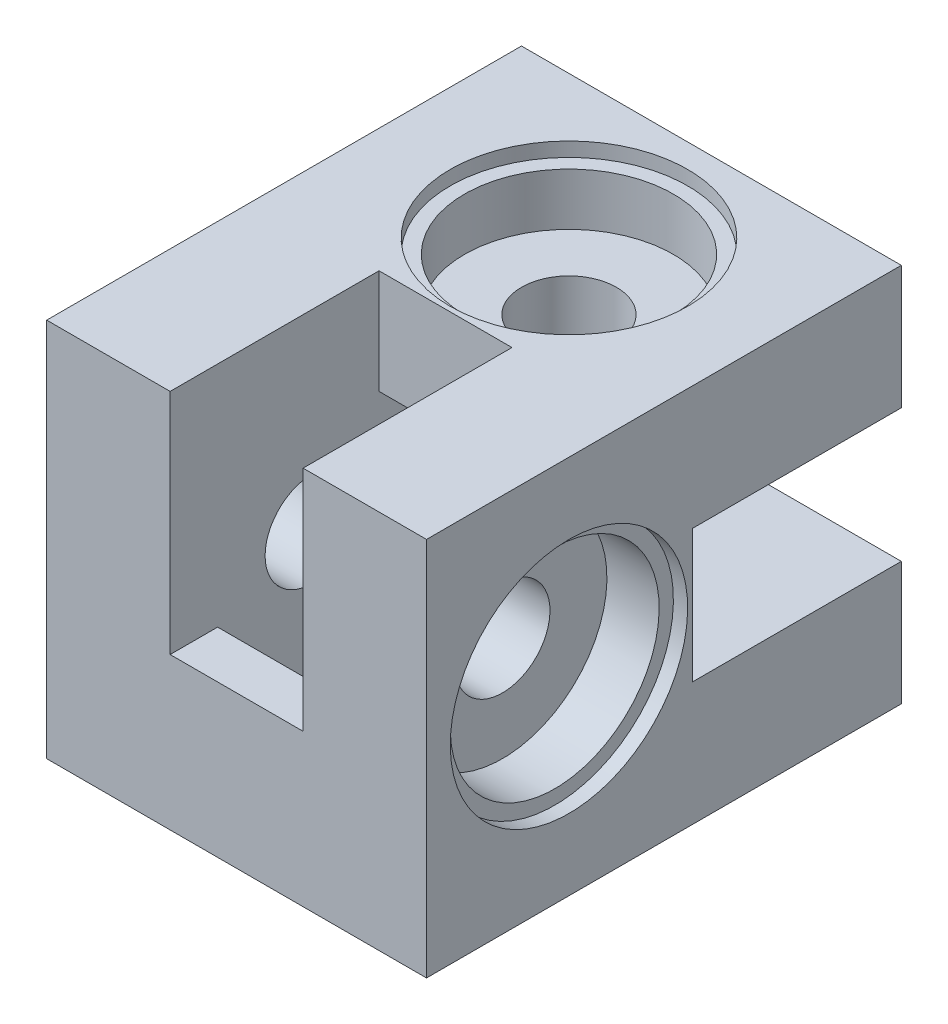
ISO-10303-21;
HEADER;
FILE_DESCRIPTION(('STEP AP214'),'2;1');
FILE_NAME('part.step','',(''),(''),'','','');
FILE_SCHEMA(('AUTOMOTIVE_DESIGN { 1 0 10303 214 1 1 1 1 }'));
ENDSEC;
DATA;
#1=APPLICATION_CONTEXT('core data for automotive mechanical design processes');
#2=APPLICATION_PROTOCOL_DEFINITION('international standard','automotive_design',2000,#1);
#3=PRODUCT_CONTEXT('',#1,'mechanical');
#4=PRODUCT('Part','Part','',(#3));
#5=PRODUCT_RELATED_PRODUCT_CATEGORY('part','',(#4));
#6=PRODUCT_DEFINITION_FORMATION('','',#4);
#7=PRODUCT_DEFINITION_CONTEXT('part definition',#1,'design');
#8=PRODUCT_DEFINITION('design','',#6,#7);
#9=PRODUCT_DEFINITION_SHAPE('','',#8);
#10=(LENGTH_UNIT() NAMED_UNIT(*) SI_UNIT(.MILLI.,.METRE.));
#11=(NAMED_UNIT(*) PLANE_ANGLE_UNIT() SI_UNIT($,.RADIAN.));
#12=(NAMED_UNIT(*) SI_UNIT($,.STERADIAN.) SOLID_ANGLE_UNIT());
#13=UNCERTAINTY_MEASURE_WITH_UNIT(LENGTH_MEASURE(1.E-05),#10,'distance_accuracy_value','');
#14=(GEOMETRIC_REPRESENTATION_CONTEXT(3) GLOBAL_UNCERTAINTY_ASSIGNED_CONTEXT((#13)) GLOBAL_UNIT_ASSIGNED_CONTEXT((#10,
#11,#12)) REPRESENTATION_CONTEXT('',''));
#15=CARTESIAN_POINT('',(0.,0.,0.));
#16=DIRECTION('',(0.,0.,1.));
#17=DIRECTION('',(1.,0.,0.));
#18=AXIS2_PLACEMENT_3D('',#15,#16,#17);
#19=CARTESIAN_POINT('',(0.,0.,0.));
#20=DIRECTION('',(0.,0.,1.));
#21=DIRECTION('',(1.,0.,0.));
#22=AXIS2_PLACEMENT_3D('',#19,#20,#21);
#23=PLANE('',#22);
#24=DIRECTION('',(-1.,0.,0.));
#25=VECTOR('',#24,1.);
#26=CARTESIAN_POINT('',(-30.,10.,0.));
#27=LINE('',#26,#25);
#28=CARTESIAN_POINT('',(-30.,10.,0.));
#29=VERTEX_POINT('',#28);
#30=CARTESIAN_POINT('',(-40.,10.,0.));
#31=VERTEX_POINT('',#30);
#32=EDGE_CURVE('E49',#29,#31,#27,.T.);
#33=ORIENTED_EDGE('',*,*,#32,.F.);
#34=DIRECTION('',(0.,1.,0.));
#35=VECTOR('',#34,1.);
#36=CARTESIAN_POINT('',(-30.,0.,0.));
#37=LINE('',#36,#35);
#38=CARTESIAN_POINT('',(-30.,0.,0.));
#39=VERTEX_POINT('',#38);
#40=EDGE_CURVE('E257',#39,#29,#37,.T.);
#41=ORIENTED_EDGE('',*,*,#40,.F.);
#42=DIRECTION('',(1.,0.,0.));
#43=VECTOR('',#42,1.);
#44=CARTESIAN_POINT('',(-40.,0.,0.));
#45=LINE('',#44,#43);
#46=CARTESIAN_POINT('',(-40.,0.,0.));
#47=VERTEX_POINT('',#46);
#48=EDGE_CURVE('E440',#47,#39,#45,.T.);
#49=ORIENTED_EDGE('',*,*,#48,.F.);
#50=DIRECTION('',(0.,-1.,0.));
#51=VECTOR('',#50,1.);
#52=CARTESIAN_POINT('',(-40.,40.,0.));
#53=LINE('',#52,#51);
#54=EDGE_CURVE('E54',#31,#47,#53,.T.);
#55=ORIENTED_EDGE('',*,*,#54,.F.);
#56=EDGE_LOOP('',(#33,#41,#49,#55));
#57=FACE_BOUND('',#56,.T.);
#58=ADVANCED_FACE('F32',(#57),#23,.F.);
#59=DIRECTION('',(0.,-1.,0.));
#60=VECTOR('',#59,1.);
#61=CARTESIAN_POINT('',(-28.,12.,0.));
#62=LINE('',#61,#60);
#63=CARTESIAN_POINT('',(-28.,12.,0.));
#64=VERTEX_POINT('',#63);
#65=CARTESIAN_POINT('',(-28.,0.,0.));
#66=VERTEX_POINT('',#65);
#67=EDGE_CURVE('E503',#64,#66,#62,.T.);
#68=ORIENTED_EDGE('',*,*,#67,.F.);
#69=DIRECTION('',(1.,0.,0.));
#70=VECTOR('',#69,1.);
#71=CARTESIAN_POINT('',(-40.,12.,0.));
#72=LINE('',#71,#70);
#73=CARTESIAN_POINT('',(-40.,12.,0.));
#74=VERTEX_POINT('',#73);
#75=EDGE_CURVE('E501',#74,#64,#72,.T.);
#76=ORIENTED_EDGE('',*,*,#75,.F.);
#77=CARTESIAN_POINT('',(-40.,40.,0.));
#78=VERTEX_POINT('',#77);
#79=EDGE_CURVE('E241',#78,#74,#53,.T.);
#80=ORIENTED_EDGE('',*,*,#79,.F.);
#81=DIRECTION('',(-1.,0.,0.));
#82=VECTOR('',#81,1.);
#83=CARTESIAN_POINT('',(-40.,40.,0.));
#84=LINE('',#83,#82);
#85=CARTESIAN_POINT('',(0.,40.,0.));
#86=VERTEX_POINT('',#85);
#87=EDGE_CURVE('E421',#86,#78,#84,.T.);
#88=ORIENTED_EDGE('',*,*,#87,.F.);
#89=DIRECTION('',(0.,1.,0.));
#90=VECTOR('',#89,1.);
#91=CARTESIAN_POINT('',(0.,40.,0.));
#92=LINE('',#91,#90);
#93=CARTESIAN_POINT('',(0.,27.,0.));
#94=VERTEX_POINT('',#93);
#95=EDGE_CURVE('E443',#94,#86,#92,.T.);
#96=ORIENTED_EDGE('',*,*,#95,.F.);
#97=DIRECTION('',(1.,0.,0.));
#98=VECTOR('',#97,1.);
#99=CARTESIAN_POINT('',(-24.,27.,0.));
#100=LINE('',#99,#98);
#101=CARTESIAN_POINT('',(-24.,27.,0.));
#102=VERTEX_POINT('',#101);
#103=EDGE_CURVE('E322',#102,#94,#100,.T.);
#104=ORIENTED_EDGE('',*,*,#103,.F.);
#105=DIRECTION('',(0.,1.,0.));
#106=VECTOR('',#105,1.);
#107=CARTESIAN_POINT('',(-24.,27.,0.));
#108=LINE('',#107,#106);
#109=CARTESIAN_POINT('',(-24.,13.,0.));
#110=VERTEX_POINT('',#109);
#111=EDGE_CURVE('E313',#110,#102,#108,.T.);
#112=ORIENTED_EDGE('',*,*,#111,.F.);
#113=DIRECTION('',(1.,0.,0.));
#114=VECTOR('',#113,1.);
#115=CARTESIAN_POINT('',(-24.,13.,0.));
#116=LINE('',#115,#114);
#117=CARTESIAN_POINT('',(0.,13.,0.));
#118=VERTEX_POINT('',#117);
#119=EDGE_CURVE('E329',#110,#118,#116,.T.);
#120=ORIENTED_EDGE('',*,*,#119,.T.);
#121=CARTESIAN_POINT('',(0.,0.,0.));
#122=VERTEX_POINT('',#121);
#123=EDGE_CURVE('E480',#122,#118,#92,.T.);
#124=ORIENTED_EDGE('',*,*,#123,.F.);
#125=EDGE_CURVE('E438',#66,#122,#45,.T.);
#126=ORIENTED_EDGE('',*,*,#125,.F.);
#127=EDGE_LOOP('',(#68,#76,#80,#88,#96,#104,#112,#120,#124,#126));
#128=FACE_BOUND('',#127,.T.);
#129=ADVANCED_FACE('F500',(#128),#23,.F.);
#130=CARTESIAN_POINT('',(-20.,33.,15.));
#131=DIRECTION('',(0.,1.,0.));
#132=DIRECTION('',(0.,0.,1.));
#133=AXIS2_PLACEMENT_3D('',#130,#131,#132);
#134=CYLINDRICAL_SURFACE('',#133,11.);
#135=CARTESIAN_POINT('',(-20.,33.,15.));
#136=DIRECTION('',(0.,1.,0.));
#137=DIRECTION('',(0.,0.,1.));
#138=AXIS2_PLACEMENT_3D('',#135,#136,#137);
#139=CIRCLE('',#138,11.);
#140=CARTESIAN_POINT('',(-20.,33.,26.));
#141=VERTEX_POINT('',#140);
#142=EDGE_CURVE('E272',#141,#141,#139,.T.);
#143=ORIENTED_EDGE('',*,*,#142,.F.);
#144=EDGE_LOOP('',(#143));
#145=FACE_BOUND('',#144,.T.);
#146=CARTESIAN_POINT('',(-20.,38.5,15.));
#147=DIRECTION('',(0.,1.,0.));
#148=DIRECTION('',(0.,0.,1.));
#149=AXIS2_PLACEMENT_3D('',#146,#147,#148);
#150=CIRCLE('',#149,11.);
#151=CARTESIAN_POINT('',(-20.,38.5,26.));
#152=VERTEX_POINT('',#151);
#153=EDGE_CURVE('E270',#152,#152,#150,.F.);
#154=ORIENTED_EDGE('',*,*,#153,.F.);
#155=EDGE_LOOP('',(#154));
#156=FACE_BOUND('',#155,.T.);
#157=ADVANCED_FACE('F533',(#145,#156),#134,.F.);
#158=CARTESIAN_POINT('',(-20.,0.,15.));
#159=DIRECTION('',(0.,1.,0.));
#160=DIRECTION('',(0.,0.,1.));
#161=AXIS2_PLACEMENT_3D('',#158,#159,#160);
#162=CYLINDRICAL_SURFACE('',#161,5.);
#163=CARTESIAN_POINT('',(-20.,27.,15.));
#164=DIRECTION('',(0.,1.,0.));
#165=DIRECTION('',(0.,0.,1.));
#166=AXIS2_PLACEMENT_3D('',#163,#164,#165);
#167=CIRCLE('',#166,5.);
#168=CARTESIAN_POINT('',(-20.,27.,20.));
#169=VERTEX_POINT('',#168);
#170=EDGE_CURVE('E399',#169,#169,#167,.F.);
#171=ORIENTED_EDGE('',*,*,#170,.T.);
#172=EDGE_LOOP('',(#171));
#173=FACE_BOUND('',#172,.T.);
#174=CARTESIAN_POINT('',(-20.,33.,15.));
#175=DIRECTION('',(0.,1.,0.));
#176=DIRECTION('',(0.,0.,1.));
#177=AXIS2_PLACEMENT_3D('',#174,#175,#176);
#178=CIRCLE('',#177,5.);
#179=CARTESIAN_POINT('',(-20.,33.,20.));
#180=VERTEX_POINT('',#179);
#181=EDGE_CURVE('E275',#180,#180,#178,.F.);
#182=ORIENTED_EDGE('',*,*,#181,.F.);
#183=EDGE_LOOP('',(#182));
#184=FACE_BOUND('',#183,.T.);
#185=ADVANCED_FACE('F560',(#173,#184),#162,.F.);
#186=CARTESIAN_POINT('',(-7.,20.,35.));
#187=DIRECTION('',(1.,0.,0.));
#188=DIRECTION('',(0.,1.,0.));
#189=AXIS2_PLACEMENT_3D('',#186,#187,#188);
#190=CYLINDRICAL_SURFACE('',#189,11.);
#191=CARTESIAN_POINT('',(-7.,20.,35.));
#192=DIRECTION('',(1.,0.,0.));
#193=DIRECTION('',(0.,1.,0.));
#194=AXIS2_PLACEMENT_3D('',#191,#192,#193);
#195=CIRCLE('',#194,11.);
#196=CARTESIAN_POINT('',(-7.,31.,35.));
#197=VERTEX_POINT('',#196);
#198=EDGE_CURVE('E283',#197,#197,#195,.T.);
#199=ORIENTED_EDGE('',*,*,#198,.F.);
#200=EDGE_LOOP('',(#199));
#201=FACE_BOUND('',#200,.T.);
#202=CARTESIAN_POINT('',(-1.5,20.,35.));
#203=DIRECTION('',(1.,0.,0.));
#204=DIRECTION('',(0.,1.,0.));
#205=AXIS2_PLACEMENT_3D('',#202,#203,#204);
#206=CIRCLE('',#205,11.);
#207=CARTESIAN_POINT('',(-1.5,31.,35.));
#208=VERTEX_POINT('',#207);
#209=EDGE_CURVE('E279',#208,#208,#206,.F.);
#210=ORIENTED_EDGE('',*,*,#209,.F.);
#211=EDGE_LOOP('',(#210));
#212=FACE_BOUND('',#211,.T.);
#213=ADVANCED_FACE('F570',(#201,#212),#190,.F.);
#214=CARTESIAN_POINT('',(0.,20.,35.));
#215=DIRECTION('',(-1.,0.,0.));
#216=DIRECTION('',(0.,0.,1.));
#217=AXIS2_PLACEMENT_3D('',#214,#215,#216);
#218=CYLINDRICAL_SURFACE('',#217,5.);
#219=CARTESIAN_POINT('',(-13.,20.,35.));
#220=DIRECTION('',(1.,0.,0.));
#221=DIRECTION('',(0.,0.,-1.));
#222=AXIS2_PLACEMENT_3D('',#219,#220,#221);
#223=CIRCLE('',#222,5.);
#224=CARTESIAN_POINT('',(-13.,20.,30.));
#225=VERTEX_POINT('',#224);
#226=EDGE_CURVE('E372',#225,#225,#223,.F.);
#227=ORIENTED_EDGE('',*,*,#226,.T.);
#228=EDGE_LOOP('',(#227));
#229=FACE_BOUND('',#228,.T.);
#230=CARTESIAN_POINT('',(-7.,20.,35.));
#231=DIRECTION('',(1.,0.,0.));
#232=DIRECTION('',(0.,1.,0.));
#233=AXIS2_PLACEMENT_3D('',#230,#231,#232);
#234=CIRCLE('',#233,5.);
#235=CARTESIAN_POINT('',(-7.,25.,35.));
#236=VERTEX_POINT('',#235);
#237=EDGE_CURVE('E286',#236,#236,#234,.F.);
#238=ORIENTED_EDGE('',*,*,#237,.F.);
#239=EDGE_LOOP('',(#238));
#240=FACE_BOUND('',#239,.T.);
#241=ADVANCED_FACE('F564',(#229,#240),#218,.F.);
#242=CARTESIAN_POINT('',(-11.,27.,25.));
#243=DIRECTION('',(0.,0.,1.));
#244=DIRECTION('',(0.,-1.,0.));
#245=AXIS2_PLACEMENT_3D('',#242,#243,#244);
#246=PLANE('',#245);
#247=DIRECTION('',(-1.,0.,0.));
#248=VECTOR('',#247,1.);
#249=CARTESIAN_POINT('',(-11.,13.,25.));
#250=LINE('',#249,#248);
#251=CARTESIAN_POINT('',(-11.,13.,25.));
#252=VERTEX_POINT('',#251);
#253=CARTESIAN_POINT('',(-13.,13.,25.));
#254=VERTEX_POINT('',#253);
#255=EDGE_CURVE('E396',#252,#254,#250,.T.);
#256=ORIENTED_EDGE('',*,*,#255,.T.);
#257=DIRECTION('',(0.,1.,0.));
#258=VECTOR('',#257,1.);
#259=CARTESIAN_POINT('',(-13.,27.,25.));
#260=LINE('',#259,#258);
#261=CARTESIAN_POINT('',(-13.,27.,25.));
#262=VERTEX_POINT('',#261);
#263=EDGE_CURVE('E460',#254,#262,#260,.T.);
#264=ORIENTED_EDGE('',*,*,#263,.T.);
#265=DIRECTION('',(-1.,0.,0.));
#266=VECTOR('',#265,1.);
#267=CARTESIAN_POINT('',(-11.,27.,25.));
#268=LINE('',#267,#266);
#269=CARTESIAN_POINT('',(-11.,27.,25.));
#270=VERTEX_POINT('',#269);
#271=EDGE_CURVE('E406',#270,#262,#268,.T.);
#272=ORIENTED_EDGE('',*,*,#271,.F.);
#273=DIRECTION('',(0.,1.,0.));
#274=VECTOR('',#273,1.);
#275=CARTESIAN_POINT('',(-11.,27.,25.));
#276=LINE('',#275,#274);
#277=EDGE_CURVE('E376',#252,#270,#276,.T.);
#278=ORIENTED_EDGE('',*,*,#277,.F.);
#279=EDGE_LOOP('',(#256,#264,#272,#278));
#280=FACE_BOUND('',#279,.T.);
#281=ADVANCED_FACE('F558',(#280),#246,.F.);
#282=CARTESIAN_POINT('',(-20.,13.,15.));
#283=DIRECTION('',(0.,-1.,0.));
#284=DIRECTION('',(0.,0.,-1.));
#285=AXIS2_PLACEMENT_3D('',#282,#283,#284);
#286=CIRCLE('',#285,5.);
#287=CARTESIAN_POINT('',(-20.,13.,10.));
#288=VERTEX_POINT('',#287);
#289=EDGE_CURVE('E414',#288,#288,#286,.F.);
#290=ORIENTED_EDGE('',*,*,#289,.T.);
#291=EDGE_LOOP('',(#290));
#292=FACE_BOUND('',#291,.T.);
#293=CARTESIAN_POINT('',(-20.,0.,15.));
#294=DIRECTION('',(0.,1.,0.));
#295=DIRECTION('',(0.,0.,1.));
#296=AXIS2_PLACEMENT_3D('',#293,#294,#295);
#297=CIRCLE('',#296,5.);
#298=CARTESIAN_POINT('',(-20.,0.,20.));
#299=VERTEX_POINT('',#298);
#300=EDGE_CURVE('E413',#299,#299,#297,.T.);
#301=ORIENTED_EDGE('',*,*,#300,.F.);
#302=EDGE_LOOP('',(#301));
#303=FACE_BOUND('',#302,.T.);
#304=ADVANCED_FACE('F549',(#292,#303),#162,.F.);
#305=CARTESIAN_POINT('',(-40.,40.,50.));
#306=DIRECTION('',(1.,0.,0.));
#307=DIRECTION('',(0.,0.,-1.));
#308=AXIS2_PLACEMENT_3D('',#305,#306,#307);
#309=PLANE('',#308);
#310=DIRECTION('',(0.,0.,-1.));
#311=VECTOR('',#310,1.);
#312=CARTESIAN_POINT('',(-40.,27.,25.));
#313=LINE('',#312,#311);
#314=CARTESIAN_POINT('',(-40.,27.,25.));
#315=VERTEX_POINT('',#314);
#316=CARTESIAN_POINT('',(-40.,27.,5.));
#317=VERTEX_POINT('',#316);
#318=EDGE_CURVE('E388',#315,#317,#313,.T.);
#319=ORIENTED_EDGE('',*,*,#318,.F.);
#320=DIRECTION('',(0.,1.,0.));
#321=VECTOR('',#320,1.);
#322=CARTESIAN_POINT('',(-40.,27.,25.));
#323=LINE('',#322,#321);
#324=CARTESIAN_POINT('',(-40.,13.,25.));
#325=VERTEX_POINT('',#324);
#326=EDGE_CURVE('E375',#325,#315,#323,.T.);
#327=ORIENTED_EDGE('',*,*,#326,.F.);
#328=DIRECTION('',(0.,0.,1.));
#329=VECTOR('',#328,1.);
#330=CARTESIAN_POINT('',(-40.,13.,25.));
#331=LINE('',#330,#329);
#332=CARTESIAN_POINT('',(-40.,13.,5.));
#333=VERTEX_POINT('',#332);
#334=EDGE_CURVE('E380',#333,#325,#331,.T.);
#335=ORIENTED_EDGE('',*,*,#334,.F.);
#336=DIRECTION('',(0.,-1.,0.));
#337=VECTOR('',#336,1.);
#338=CARTESIAN_POINT('',(-40.,27.,5.));
#339=LINE('',#338,#337);
#340=EDGE_CURVE('E391',#317,#333,#339,.T.);
#341=ORIENTED_EDGE('',*,*,#340,.F.);
#342=EDGE_LOOP('',(#319,#327,#335,#341));
#343=FACE_BOUND('',#342,.T.);
#344=CARTESIAN_POINT('',(-40.,20.,35.));
#345=DIRECTION('',(-1.,0.,0.));
#346=DIRECTION('',(0.,0.,1.));
#347=AXIS2_PLACEMENT_3D('',#344,#345,#346);
#348=CIRCLE('',#347,5.);
#349=CARTESIAN_POINT('',(-40.,20.,40.));
#350=VERTEX_POINT('',#349);
#351=EDGE_CURVE('E410',#350,#350,#348,.T.);
#352=ORIENTED_EDGE('',*,*,#351,.F.);
#353=EDGE_LOOP('',(#352));
#354=FACE_BOUND('',#353,.T.);
#355=ORIENTED_EDGE('',*,*,#79,.T.);
#356=DIRECTION('',(0.,0.,1.));
#357=VECTOR('',#356,1.);
#358=CARTESIAN_POINT('',(-40.,12.,-20.));
#359=LINE('',#358,#357);
#360=CARTESIAN_POINT('',(-40.,12.,-20.));
#361=VERTEX_POINT('',#360);
#362=EDGE_CURVE('E222',#361,#74,#359,.T.);
#363=ORIENTED_EDGE('',*,*,#362,.F.);
#364=DIRECTION('',(0.,1.,0.));
#365=VECTOR('',#364,1.);
#366=CARTESIAN_POINT('',(-40.,10.,-20.));
#367=LINE('',#366,#365);
#368=CARTESIAN_POINT('',(-40.,10.,-20.));
#369=VERTEX_POINT('',#368);
#370=EDGE_CURVE('E228',#369,#361,#367,.T.);
#371=ORIENTED_EDGE('',*,*,#370,.F.);
#372=DIRECTION('',(0.,0.,1.));
#373=VECTOR('',#372,1.);
#374=CARTESIAN_POINT('',(-40.,10.,-20.));
#375=LINE('',#374,#373);
#376=EDGE_CURVE('E258',#369,#31,#375,.T.);
#377=ORIENTED_EDGE('',*,*,#376,.T.);
#378=ORIENTED_EDGE('',*,*,#54,.T.);
#379=DIRECTION('',(0.,0.,-1.));
#380=VECTOR('',#379,1.);
#381=CARTESIAN_POINT('',(-40.,0.,50.));
#382=LINE('',#381,#380);
#383=CARTESIAN_POINT('',(-40.,0.,50.));
#384=VERTEX_POINT('',#383);
#385=EDGE_CURVE('E466',#384,#47,#382,.T.);
#386=ORIENTED_EDGE('',*,*,#385,.F.);
#387=DIRECTION('',(0.,-1.,0.));
#388=VECTOR('',#387,1.);
#389=CARTESIAN_POINT('',(-40.,40.,50.));
#390=LINE('',#389,#388);
#391=CARTESIAN_POINT('',(-40.,40.,50.));
#392=VERTEX_POINT('',#391);
#393=EDGE_CURVE('E417',#392,#384,#390,.T.);
#394=ORIENTED_EDGE('',*,*,#393,.F.);
#395=DIRECTION('',(0.,0.,-1.));
#396=VECTOR('',#395,1.);
#397=CARTESIAN_POINT('',(-40.,40.,50.));
#398=LINE('',#397,#396);
#399=EDGE_CURVE('E429',#392,#78,#398,.T.);
#400=ORIENTED_EDGE('',*,*,#399,.T.);
#401=EDGE_LOOP('',(#355,#363,#371,#377,#378,#386,#394,#400));
#402=FACE_BOUND('',#401,.T.);
#403=ADVANCED_FACE('F34',(#343,#354,#402),#309,.F.);
#404=CARTESIAN_POINT('',(-40.,0.,50.));
#405=DIRECTION('',(0.,1.,0.));
#406=DIRECTION('',(0.,0.,1.));
#407=AXIS2_PLACEMENT_3D('',#404,#405,#406);
#408=PLANE('',#407);
#409=DIRECTION('',(-1.,0.,0.));
#410=VECTOR('',#409,1.);
#411=CARTESIAN_POINT('',(-13.,0.,45.));
#412=LINE('',#411,#410);
#413=CARTESIAN_POINT('',(-13.,0.,45.));
#414=VERTEX_POINT('',#413);
#415=CARTESIAN_POINT('',(-27.,0.,45.));
#416=VERTEX_POINT('',#415);
#417=EDGE_CURVE('E350',#414,#416,#412,.T.);
#418=ORIENTED_EDGE('',*,*,#417,.F.);
#419=DIRECTION('',(0.,0.,1.));
#420=VECTOR('',#419,1.);
#421=CARTESIAN_POINT('',(-13.,0.,25.));
#422=LINE('',#421,#420);
#423=CARTESIAN_POINT('',(-13.,0.,25.));
#424=VERTEX_POINT('',#423);
#425=EDGE_CURVE('E332',#424,#414,#422,.T.);
#426=ORIENTED_EDGE('',*,*,#425,.F.);
#427=DIRECTION('',(1.,0.,0.));
#428=VECTOR('',#427,1.);
#429=CARTESIAN_POINT('',(-13.,0.,25.));
#430=LINE('',#429,#428);
#431=CARTESIAN_POINT('',(-27.,0.,25.));
#432=VERTEX_POINT('',#431);
#433=EDGE_CURVE('E342',#432,#424,#430,.T.);
#434=ORIENTED_EDGE('',*,*,#433,.F.);
#435=DIRECTION('',(0.,0.,-1.));
#436=VECTOR('',#435,1.);
#437=CARTESIAN_POINT('',(-27.,0.,25.));
#438=LINE('',#437,#436);
#439=EDGE_CURVE('E353',#416,#432,#438,.T.);
#440=ORIENTED_EDGE('',*,*,#439,.F.);
#441=EDGE_LOOP('',(#418,#426,#434,#440));
#442=FACE_BOUND('',#441,.T.);
#443=ORIENTED_EDGE('',*,*,#300,.T.);
#444=EDGE_LOOP('',(#443));
#445=FACE_BOUND('',#444,.T.);
#446=ORIENTED_EDGE('',*,*,#48,.T.);
#447=DIRECTION('',(0.,0.,1.));
#448=VECTOR('',#447,1.);
#449=CARTESIAN_POINT('',(-30.,0.,-20.));
#450=LINE('',#449,#448);
#451=CARTESIAN_POINT('',(-30.,0.,-20.));
#452=VERTEX_POINT('',#451);
#453=EDGE_CURVE('E267',#452,#39,#450,.T.);
#454=ORIENTED_EDGE('',*,*,#453,.F.);
#455=DIRECTION('',(-1.,0.,0.));
#456=VECTOR('',#455,1.);
#457=CARTESIAN_POINT('',(-28.,0.,-20.));
#458=LINE('',#457,#456);
#459=CARTESIAN_POINT('',(-28.,0.,-20.));
#460=VERTEX_POINT('',#459);
#461=EDGE_CURVE('E525',#460,#452,#458,.T.);
#462=ORIENTED_EDGE('',*,*,#461,.F.);
#463=DIRECTION('',(0.,0.,1.));
#464=VECTOR('',#463,1.);
#465=CARTESIAN_POINT('',(-28.,0.,-20.));
#466=LINE('',#465,#464);
#467=EDGE_CURVE('E247',#460,#66,#466,.T.);
#468=ORIENTED_EDGE('',*,*,#467,.T.);
#469=ORIENTED_EDGE('',*,*,#125,.T.);
#470=DIRECTION('',(0.,0.,-1.));
#471=VECTOR('',#470,1.);
#472=CARTESIAN_POINT('',(0.,0.,50.));
#473=LINE('',#472,#471);
#474=CARTESIAN_POINT('',(0.,0.,50.));
#475=VERTEX_POINT('',#474);
#476=EDGE_CURVE('E473',#475,#122,#473,.T.);
#477=ORIENTED_EDGE('',*,*,#476,.F.);
#478=DIRECTION('',(1.,0.,0.));
#479=VECTOR('',#478,1.);
#480=CARTESIAN_POINT('',(-40.,0.,50.));
#481=LINE('',#480,#479);
#482=EDGE_CURVE('E420',#384,#475,#481,.T.);
#483=ORIENTED_EDGE('',*,*,#482,.F.);
#484=ORIENTED_EDGE('',*,*,#385,.T.);
#485=EDGE_LOOP('',(#446,#454,#462,#468,#469,#477,#483,#484));
#486=FACE_BOUND('',#485,.T.);
#487=ADVANCED_FACE('F524',(#442,#445,#486),#408,.F.);
#488=CARTESIAN_POINT('',(0.,40.,50.));
#489=DIRECTION('',(-1.,0.,0.));
#490=DIRECTION('',(0.,-1.,0.));
#491=AXIS2_PLACEMENT_3D('',#488,#489,#490);
#492=PLANE('',#491);
#493=CARTESIAN_POINT('',(0.,20.,35.));
#494=DIRECTION('',(1.,0.,0.));
#495=DIRECTION('',(0.,1.,0.));
#496=AXIS2_PLACEMENT_3D('',#493,#494,#495);
#497=CIRCLE('',#496,12.5);
#498=CARTESIAN_POINT('',(0.,32.5,35.));
#499=VERTEX_POINT('',#498);
#500=EDGE_CURVE('E280',#499,#499,#497,.T.);
#501=ORIENTED_EDGE('',*,*,#500,.F.);
#502=EDGE_LOOP('',(#501));
#503=FACE_BOUND('',#502,.T.);
#504=ORIENTED_EDGE('',*,*,#123,.T.);
#505=DIRECTION('',(0.,0.,-1.));
#506=VECTOR('',#505,1.);
#507=CARTESIAN_POINT('',(0.,13.,0.));
#508=LINE('',#507,#506);
#509=CARTESIAN_POINT('',(0.,13.,22.));
#510=VERTEX_POINT('',#509);
#511=EDGE_CURVE('E317',#510,#118,#508,.T.);
#512=ORIENTED_EDGE('',*,*,#511,.F.);
#513=DIRECTION('',(0.,-1.,0.));
#514=VECTOR('',#513,1.);
#515=CARTESIAN_POINT('',(0.,27.,22.));
#516=LINE('',#515,#514);
#517=CARTESIAN_POINT('',(0.,27.,22.));
#518=VERTEX_POINT('',#517);
#519=EDGE_CURVE('E325',#518,#510,#516,.T.);
#520=ORIENTED_EDGE('',*,*,#519,.F.);
#521=DIRECTION('',(0.,0.,1.));
#522=VECTOR('',#521,1.);
#523=CARTESIAN_POINT('',(0.,27.,0.));
#524=LINE('',#523,#522);
#525=EDGE_CURVE('E306',#94,#518,#524,.T.);
#526=ORIENTED_EDGE('',*,*,#525,.F.);
#527=ORIENTED_EDGE('',*,*,#95,.T.);
#528=DIRECTION('',(0.,0.,-1.));
#529=VECTOR('',#528,1.);
#530=CARTESIAN_POINT('',(0.,40.,50.));
#531=LINE('',#530,#529);
#532=CARTESIAN_POINT('',(0.,40.,50.));
#533=VERTEX_POINT('',#532);
#534=EDGE_CURVE('E476',#533,#86,#531,.T.);
#535=ORIENTED_EDGE('',*,*,#534,.F.);
#536=DIRECTION('',(0.,1.,0.));
#537=VECTOR('',#536,1.);
#538=CARTESIAN_POINT('',(0.,40.,50.));
#539=LINE('',#538,#537);
#540=EDGE_CURVE('E423',#475,#533,#539,.T.);
#541=ORIENTED_EDGE('',*,*,#540,.F.);
#542=ORIENTED_EDGE('',*,*,#476,.T.);
#543=EDGE_LOOP('',(#504,#512,#520,#526,#527,#535,#541,#542));
#544=FACE_BOUND('',#543,.T.);
#545=ADVANCED_FACE('F488',(#503,#544),#492,.F.);
#546=CARTESIAN_POINT('',(-40.,40.,50.));
#547=DIRECTION('',(0.,-1.,0.));
#548=DIRECTION('',(0.,0.,-1.));
#549=AXIS2_PLACEMENT_3D('',#546,#547,#548);
#550=PLANE('',#549);
#551=CARTESIAN_POINT('',(-20.,40.,15.));
#552=DIRECTION('',(0.,1.,0.));
#553=DIRECTION('',(0.,0.,1.));
#554=AXIS2_PLACEMENT_3D('',#551,#552,#553);
#555=CIRCLE('',#554,12.5);
#556=CARTESIAN_POINT('',(-20.,40.,27.5));
#557=VERTEX_POINT('',#556);
#558=EDGE_CURVE('E242',#557,#557,#555,.T.);
#559=ORIENTED_EDGE('',*,*,#558,.F.);
#560=EDGE_LOOP('',(#559));
#561=FACE_BOUND('',#560,.T.);
#562=DIRECTION('',(-1.,0.,0.));
#563=VECTOR('',#562,1.);
#564=CARTESIAN_POINT('',(-40.,40.,50.));
#565=LINE('',#564,#563);
#566=CARTESIAN_POINT('',(-27.,40.,50.));
#567=VERTEX_POINT('',#566);
#568=EDGE_CURVE('E425',#567,#392,#565,.T.);
#569=ORIENTED_EDGE('',*,*,#568,.F.);
#570=DIRECTION('',(0.,0.,1.));
#571=VECTOR('',#570,1.);
#572=CARTESIAN_POINT('',(-27.,40.,50.));
#573=LINE('',#572,#571);
#574=CARTESIAN_POINT('',(-27.,40.,28.));
#575=VERTEX_POINT('',#574);
#576=EDGE_CURVE('E297',#575,#567,#573,.T.);
#577=ORIENTED_EDGE('',*,*,#576,.F.);
#578=DIRECTION('',(-1.,0.,0.));
#579=VECTOR('',#578,1.);
#580=CARTESIAN_POINT('',(-27.,40.,28.));
#581=LINE('',#580,#579);
#582=CARTESIAN_POINT('',(-13.,40.,28.));
#583=VERTEX_POINT('',#582);
#584=EDGE_CURVE('E291',#583,#575,#581,.T.);
#585=ORIENTED_EDGE('',*,*,#584,.F.);
#586=DIRECTION('',(0.,0.,-1.));
#587=VECTOR('',#586,1.);
#588=CARTESIAN_POINT('',(-13.,40.,50.));
#589=LINE('',#588,#587);
#590=CARTESIAN_POINT('',(-13.,40.,50.));
#591=VERTEX_POINT('',#590);
#592=EDGE_CURVE('E299',#591,#583,#589,.T.);
#593=ORIENTED_EDGE('',*,*,#592,.F.);
#594=EDGE_CURVE('E426',#533,#591,#565,.T.);
#595=ORIENTED_EDGE('',*,*,#594,.F.);
#596=ORIENTED_EDGE('',*,*,#534,.T.);
#597=ORIENTED_EDGE('',*,*,#87,.T.);
#598=ORIENTED_EDGE('',*,*,#399,.F.);
#599=EDGE_LOOP('',(#569,#577,#585,#593,#595,#596,#597,#598));
#600=FACE_BOUND('',#599,.T.);
#601=ADVANCED_FACE('F497',(#561,#600),#550,.F.);
#602=CARTESIAN_POINT('',(0.,0.,50.));
#603=DIRECTION('',(0.,0.,1.));
#604=DIRECTION('',(1.,0.,0.));
#605=AXIS2_PLACEMENT_3D('',#602,#603,#604);
#606=PLANE('',#605);
#607=DIRECTION('',(0.,1.,0.));
#608=VECTOR('',#607,1.);
#609=CARTESIAN_POINT('',(-27.,16.,50.));
#610=LINE('',#609,#608);
#611=CARTESIAN_POINT('',(-27.,16.,50.));
#612=VERTEX_POINT('',#611);
#613=EDGE_CURVE('E296',#612,#567,#610,.T.);
#614=ORIENTED_EDGE('',*,*,#613,.T.);
#615=ORIENTED_EDGE('',*,*,#568,.T.);
#616=ORIENTED_EDGE('',*,*,#393,.T.);
#617=ORIENTED_EDGE('',*,*,#482,.T.);
#618=ORIENTED_EDGE('',*,*,#540,.T.);
#619=ORIENTED_EDGE('',*,*,#594,.T.);
#620=DIRECTION('',(0.,1.,0.));
#621=VECTOR('',#620,1.);
#622=CARTESIAN_POINT('',(-13.,16.,50.));
#623=LINE('',#622,#621);
#624=CARTESIAN_POINT('',(-13.,16.,50.));
#625=VERTEX_POINT('',#624);
#626=EDGE_CURVE('E309',#625,#591,#623,.T.);
#627=ORIENTED_EDGE('',*,*,#626,.F.);
#628=DIRECTION('',(1.,0.,0.));
#629=VECTOR('',#628,1.);
#630=CARTESIAN_POINT('',(-27.,16.,50.));
#631=LINE('',#630,#629);
#632=EDGE_CURVE('E290',#612,#625,#631,.T.);
#633=ORIENTED_EDGE('',*,*,#632,.F.);
#634=EDGE_LOOP('',(#614,#615,#616,#617,#618,#619,#627,#633));
#635=FACE_BOUND('',#634,.T.);
#636=ADVANCED_FACE('F536',(#635),#606,.T.);
#637=CARTESIAN_POINT('',(-27.,20.,35.));
#638=DIRECTION('',(-1.,0.,0.));
#639=DIRECTION('',(0.,0.,1.));
#640=AXIS2_PLACEMENT_3D('',#637,#638,#639);
#641=CIRCLE('',#640,5.);
#642=CARTESIAN_POINT('',(-27.,20.,40.));
#643=VERTEX_POINT('',#642);
#644=EDGE_CURVE('E361',#643,#643,#641,.F.);
#645=ORIENTED_EDGE('',*,*,#644,.T.);
#646=EDGE_LOOP('',(#645));
#647=FACE_BOUND('',#646,.T.);
#648=ORIENTED_EDGE('',*,*,#351,.T.);
#649=EDGE_LOOP('',(#648));
#650=FACE_BOUND('',#649,.T.);
#651=ADVANCED_FACE('F655',(#647,#650),#218,.F.);
#652=CARTESIAN_POINT('',(-11.,13.,25.));
#653=DIRECTION('',(0.,-1.,0.));
#654=DIRECTION('',(0.,0.,-1.));
#655=AXIS2_PLACEMENT_3D('',#652,#653,#654);
#656=PLANE('',#655);
#657=ORIENTED_EDGE('',*,*,#289,.F.);
#658=EDGE_LOOP('',(#657));
#659=FACE_BOUND('',#658,.T.);
#660=DIRECTION('',(0.,0.,1.));
#661=VECTOR('',#660,1.);
#662=CARTESIAN_POINT('',(-11.,13.,25.));
#663=LINE('',#662,#661);
#664=CARTESIAN_POINT('',(-11.,13.,22.));
#665=VERTEX_POINT('',#664);
#666=EDGE_CURVE('E383',#665,#252,#663,.T.);
#667=ORIENTED_EDGE('',*,*,#666,.F.);
#668=DIRECTION('',(1.,0.,0.));
#669=VECTOR('',#668,1.);
#670=CARTESIAN_POINT('',(-24.,13.,22.));
#671=LINE('',#670,#669);
#672=EDGE_CURVE('E333',#665,#510,#671,.T.);
#673=ORIENTED_EDGE('',*,*,#672,.T.);
#674=ORIENTED_EDGE('',*,*,#511,.T.);
#675=ORIENTED_EDGE('',*,*,#119,.F.);
#676=DIRECTION('',(0.,0.,-1.));
#677=VECTOR('',#676,1.);
#678=CARTESIAN_POINT('',(-24.,13.,0.));
#679=LINE('',#678,#677);
#680=CARTESIAN_POINT('',(-24.,13.,5.));
#681=VERTEX_POINT('',#680);
#682=EDGE_CURVE('E319',#681,#110,#679,.T.);
#683=ORIENTED_EDGE('',*,*,#682,.F.);
#684=DIRECTION('',(-1.,0.,0.));
#685=VECTOR('',#684,1.);
#686=CARTESIAN_POINT('',(-11.,13.,5.));
#687=LINE('',#686,#685);
#688=EDGE_CURVE('E402',#681,#333,#687,.T.);
#689=ORIENTED_EDGE('',*,*,#688,.T.);
#690=ORIENTED_EDGE('',*,*,#334,.T.);
#691=CARTESIAN_POINT('',(-27.,13.,25.));
#692=VERTEX_POINT('',#691);
#693=EDGE_CURVE('E401',#692,#325,#250,.T.);
#694=ORIENTED_EDGE('',*,*,#693,.F.);
#695=EDGE_CURVE('E400',#254,#692,#250,.T.);
#696=ORIENTED_EDGE('',*,*,#695,.F.);
#697=ORIENTED_EDGE('',*,*,#255,.F.);
#698=EDGE_LOOP('',(#667,#673,#674,#675,#683,#689,#690,#694,#696,#697));
#699=FACE_BOUND('',#698,.T.);
#700=ADVANCED_FACE('F651',(#659,#699),#656,.F.);
#701=CARTESIAN_POINT('',(-11.,27.,25.));
#702=DIRECTION('',(0.,1.,0.));
#703=DIRECTION('',(0.,0.,1.));
#704=AXIS2_PLACEMENT_3D('',#701,#702,#703);
#705=PLANE('',#704);
#706=DIRECTION('',(1.,0.,0.));
#707=VECTOR('',#706,1.);
#708=CARTESIAN_POINT('',(-24.,27.,22.));
#709=LINE('',#708,#707);
#710=CARTESIAN_POINT('',(-11.,27.,22.));
#711=VERTEX_POINT('',#710);
#712=EDGE_CURVE('E335',#711,#518,#709,.T.);
#713=ORIENTED_EDGE('',*,*,#712,.F.);
#714=DIRECTION('',(0.,0.,-1.));
#715=VECTOR('',#714,1.);
#716=CARTESIAN_POINT('',(-11.,27.,25.));
#717=LINE('',#716,#715);
#718=EDGE_CURVE('E379',#270,#711,#717,.T.);
#719=ORIENTED_EDGE('',*,*,#718,.F.);
#720=ORIENTED_EDGE('',*,*,#271,.T.);
#721=CARTESIAN_POINT('',(-27.,27.,25.));
#722=VERTEX_POINT('',#721);
#723=EDGE_CURVE('E409',#262,#722,#268,.T.);
#724=ORIENTED_EDGE('',*,*,#723,.T.);
#725=EDGE_CURVE('E385',#722,#315,#268,.T.);
#726=ORIENTED_EDGE('',*,*,#725,.T.);
#727=ORIENTED_EDGE('',*,*,#318,.T.);
#728=DIRECTION('',(-1.,0.,0.));
#729=VECTOR('',#728,1.);
#730=CARTESIAN_POINT('',(-11.,27.,5.));
#731=LINE('',#730,#729);
#732=CARTESIAN_POINT('',(-24.,27.,5.));
#733=VERTEX_POINT('',#732);
#734=EDGE_CURVE('E404',#733,#317,#731,.T.);
#735=ORIENTED_EDGE('',*,*,#734,.F.);
#736=DIRECTION('',(0.,0.,1.));
#737=VECTOR('',#736,1.);
#738=CARTESIAN_POINT('',(-24.,27.,0.));
#739=LINE('',#738,#737);
#740=EDGE_CURVE('E316',#102,#733,#739,.T.);
#741=ORIENTED_EDGE('',*,*,#740,.F.);
#742=ORIENTED_EDGE('',*,*,#103,.T.);
#743=ORIENTED_EDGE('',*,*,#525,.T.);
#744=EDGE_LOOP('',(#713,#719,#720,#724,#726,#727,#735,#741,#742,#743));
#745=FACE_BOUND('',#744,.T.);
#746=ORIENTED_EDGE('',*,*,#170,.F.);
#747=EDGE_LOOP('',(#746));
#748=FACE_BOUND('',#747,.T.);
#749=ADVANCED_FACE('F654',(#745,#748),#705,.F.);
#750=ORIENTED_EDGE('',*,*,#725,.F.);
#751=DIRECTION('',(0.,-1.,0.));
#752=VECTOR('',#751,1.);
#753=CARTESIAN_POINT('',(-27.,27.,25.));
#754=LINE('',#753,#752);
#755=EDGE_CURVE('E463',#722,#692,#754,.T.);
#756=ORIENTED_EDGE('',*,*,#755,.T.);
#757=ORIENTED_EDGE('',*,*,#693,.T.);
#758=ORIENTED_EDGE('',*,*,#326,.T.);
#759=EDGE_LOOP('',(#750,#756,#757,#758));
#760=FACE_BOUND('',#759,.T.);
#761=ADVANCED_FACE('F567',(#760),#246,.F.);
#762=CARTESIAN_POINT('',(-11.,27.,5.));
#763=DIRECTION('',(0.,0.,-1.));
#764=DIRECTION('',(0.,1.,0.));
#765=AXIS2_PLACEMENT_3D('',#762,#763,#764);
#766=PLANE('',#765);
#767=ORIENTED_EDGE('',*,*,#688,.F.);
#768=DIRECTION('',(0.,1.,0.));
#769=VECTOR('',#768,1.);
#770=CARTESIAN_POINT('',(-24.,27.,5.));
#771=LINE('',#770,#769);
#772=EDGE_CURVE('E454',#681,#733,#771,.T.);
#773=ORIENTED_EDGE('',*,*,#772,.T.);
#774=ORIENTED_EDGE('',*,*,#734,.T.);
#775=ORIENTED_EDGE('',*,*,#340,.T.);
#776=EDGE_LOOP('',(#767,#773,#774,#775));
#777=FACE_BOUND('',#776,.T.);
#778=ADVANCED_FACE('F649',(#777),#766,.F.);
#779=CARTESIAN_POINT('',(-11.,0.,0.));
#780=DIRECTION('',(1.,0.,0.));
#781=DIRECTION('',(0.,0.,-1.));
#782=AXIS2_PLACEMENT_3D('',#779,#780,#781);
#783=PLANE('',#782);
#784=ORIENTED_EDGE('',*,*,#718,.T.);
#785=DIRECTION('',(0.,-1.,0.));
#786=VECTOR('',#785,1.);
#787=CARTESIAN_POINT('',(-11.,0.,22.));
#788=LINE('',#787,#786);
#789=EDGE_CURVE('E457',#711,#665,#788,.T.);
#790=ORIENTED_EDGE('',*,*,#789,.T.);
#791=ORIENTED_EDGE('',*,*,#666,.T.);
#792=ORIENTED_EDGE('',*,*,#277,.T.);
#793=EDGE_LOOP('',(#784,#790,#791,#792));
#794=FACE_BOUND('',#793,.T.);
#795=ADVANCED_FACE('F634',(#794),#783,.F.);
#796=CARTESIAN_POINT('',(-13.,29.,25.));
#797=DIRECTION('',(0.,0.,-1.));
#798=DIRECTION('',(-1.,0.,0.));
#799=AXIS2_PLACEMENT_3D('',#796,#797,#798);
#800=PLANE('',#799);
#801=DIRECTION('',(0.,-1.,0.));
#802=VECTOR('',#801,1.);
#803=CARTESIAN_POINT('',(-27.,29.,25.));
#804=LINE('',#803,#802);
#805=EDGE_CURVE('E366',#692,#432,#804,.T.);
#806=ORIENTED_EDGE('',*,*,#805,.T.);
#807=ORIENTED_EDGE('',*,*,#433,.T.);
#808=DIRECTION('',(0.,-1.,0.));
#809=VECTOR('',#808,1.);
#810=CARTESIAN_POINT('',(-13.,29.,25.));
#811=LINE('',#810,#809);
#812=EDGE_CURVE('E362',#254,#424,#811,.T.);
#813=ORIENTED_EDGE('',*,*,#812,.F.);
#814=ORIENTED_EDGE('',*,*,#695,.T.);
#815=EDGE_LOOP('',(#806,#807,#813,#814));
#816=FACE_BOUND('',#815,.T.);
#817=ADVANCED_FACE('F630',(#816),#800,.F.);
#818=CARTESIAN_POINT('',(-13.,29.,25.));
#819=VERTEX_POINT('',#818);
#820=EDGE_CURVE('E358',#819,#262,#811,.T.);
#821=ORIENTED_EDGE('',*,*,#820,.F.);
#822=DIRECTION('',(1.,0.,0.));
#823=VECTOR('',#822,1.);
#824=CARTESIAN_POINT('',(-13.,29.,25.));
#825=LINE('',#824,#823);
#826=CARTESIAN_POINT('',(-27.,29.,25.));
#827=VERTEX_POINT('',#826);
#828=EDGE_CURVE('E344',#827,#819,#825,.T.);
#829=ORIENTED_EDGE('',*,*,#828,.F.);
#830=EDGE_CURVE('E363',#827,#722,#804,.T.);
#831=ORIENTED_EDGE('',*,*,#830,.T.);
#832=ORIENTED_EDGE('',*,*,#723,.F.);
#833=EDGE_LOOP('',(#821,#829,#831,#832));
#834=FACE_BOUND('',#833,.T.);
#835=ADVANCED_FACE('F633',(#834),#800,.F.);
#836=CARTESIAN_POINT('',(-13.,29.,25.));
#837=DIRECTION('',(1.,0.,0.));
#838=DIRECTION('',(0.,0.,-1.));
#839=AXIS2_PLACEMENT_3D('',#836,#837,#838);
#840=PLANE('',#839);
#841=DIRECTION('',(0.,1.,0.));
#842=VECTOR('',#841,1.);
#843=CARTESIAN_POINT('',(-13.,16.,28.));
#844=LINE('',#843,#842);
#845=CARTESIAN_POINT('',(-13.,29.,28.));
#846=VERTEX_POINT('',#845);
#847=EDGE_CURVE('E307',#846,#583,#844,.T.);
#848=ORIENTED_EDGE('',*,*,#847,.F.);
#849=DIRECTION('',(0.,0.,1.));
#850=VECTOR('',#849,1.);
#851=CARTESIAN_POINT('',(-13.,29.,25.));
#852=LINE('',#851,#850);
#853=EDGE_CURVE('E338',#819,#846,#852,.T.);
#854=ORIENTED_EDGE('',*,*,#853,.F.);
#855=ORIENTED_EDGE('',*,*,#820,.T.);
#856=ORIENTED_EDGE('',*,*,#263,.F.);
#857=ORIENTED_EDGE('',*,*,#812,.T.);
#858=ORIENTED_EDGE('',*,*,#425,.T.);
#859=DIRECTION('',(0.,-1.,0.));
#860=VECTOR('',#859,1.);
#861=CARTESIAN_POINT('',(-13.,29.,45.));
#862=LINE('',#861,#860);
#863=CARTESIAN_POINT('',(-13.,16.,45.));
#864=VERTEX_POINT('',#863);
#865=EDGE_CURVE('E347',#864,#414,#862,.T.);
#866=ORIENTED_EDGE('',*,*,#865,.F.);
#867=DIRECTION('',(0.,0.,-1.));
#868=VECTOR('',#867,1.);
#869=CARTESIAN_POINT('',(-13.,16.,50.));
#870=LINE('',#869,#868);
#871=EDGE_CURVE('E294',#625,#864,#870,.T.);
#872=ORIENTED_EDGE('',*,*,#871,.F.);
#873=ORIENTED_EDGE('',*,*,#626,.T.);
#874=ORIENTED_EDGE('',*,*,#592,.T.);
#875=EDGE_LOOP('',(#848,#854,#855,#856,#857,#858,#866,#872,#873,#874));
#876=FACE_BOUND('',#875,.T.);
#877=ORIENTED_EDGE('',*,*,#226,.F.);
#878=EDGE_LOOP('',(#877));
#879=FACE_BOUND('',#878,.T.);
#880=ADVANCED_FACE('F639',(#876,#879),#840,.F.);
#881=CARTESIAN_POINT('',(-27.,29.,25.));
#882=DIRECTION('',(-1.,0.,0.));
#883=DIRECTION('',(0.,0.,1.));
#884=AXIS2_PLACEMENT_3D('',#881,#882,#883);
#885=PLANE('',#884);
#886=ORIENTED_EDGE('',*,*,#644,.F.);
#887=EDGE_LOOP('',(#886));
#888=FACE_BOUND('',#887,.T.);
#889=DIRECTION('',(0.,0.,-1.));
#890=VECTOR('',#889,1.);
#891=CARTESIAN_POINT('',(-27.,29.,25.));
#892=LINE('',#891,#890);
#893=CARTESIAN_POINT('',(-27.,29.,28.));
#894=VERTEX_POINT('',#893);
#895=EDGE_CURVE('E341',#894,#827,#892,.T.);
#896=ORIENTED_EDGE('',*,*,#895,.F.);
#897=DIRECTION('',(0.,1.,0.));
#898=VECTOR('',#897,1.);
#899=CARTESIAN_POINT('',(-27.,16.,28.));
#900=LINE('',#899,#898);
#901=EDGE_CURVE('E304',#894,#575,#900,.T.);
#902=ORIENTED_EDGE('',*,*,#901,.T.);
#903=ORIENTED_EDGE('',*,*,#576,.T.);
#904=ORIENTED_EDGE('',*,*,#613,.F.);
#905=DIRECTION('',(0.,0.,1.));
#906=VECTOR('',#905,1.);
#907=CARTESIAN_POINT('',(-27.,16.,50.));
#908=LINE('',#907,#906);
#909=CARTESIAN_POINT('',(-27.,16.,45.));
#910=VERTEX_POINT('',#909);
#911=EDGE_CURVE('E287',#910,#612,#908,.T.);
#912=ORIENTED_EDGE('',*,*,#911,.F.);
#913=DIRECTION('',(0.,-1.,0.));
#914=VECTOR('',#913,1.);
#915=CARTESIAN_POINT('',(-27.,29.,45.));
#916=LINE('',#915,#914);
#917=EDGE_CURVE('E367',#910,#416,#916,.T.);
#918=ORIENTED_EDGE('',*,*,#917,.T.);
#919=ORIENTED_EDGE('',*,*,#439,.T.);
#920=ORIENTED_EDGE('',*,*,#805,.F.);
#921=ORIENTED_EDGE('',*,*,#755,.F.);
#922=ORIENTED_EDGE('',*,*,#830,.F.);
#923=EDGE_LOOP('',(#896,#902,#903,#904,#912,#918,#919,#920,#921,#922));
#924=FACE_BOUND('',#923,.T.);
#925=ADVANCED_FACE('F636',(#888,#924),#885,.F.);
#926=CARTESIAN_POINT('',(-13.,29.,45.));
#927=DIRECTION('',(0.,0.,1.));
#928=DIRECTION('',(1.,0.,0.));
#929=AXIS2_PLACEMENT_3D('',#926,#927,#928);
#930=PLANE('',#929);
#931=ORIENTED_EDGE('',*,*,#917,.F.);
#932=DIRECTION('',(1.,0.,0.));
#933=VECTOR('',#932,1.);
#934=CARTESIAN_POINT('',(-13.,16.,45.));
#935=LINE('',#934,#933);
#936=EDGE_CURVE('E11',#910,#864,#935,.T.);
#937=ORIENTED_EDGE('',*,*,#936,.T.);
#938=ORIENTED_EDGE('',*,*,#865,.T.);
#939=ORIENTED_EDGE('',*,*,#417,.T.);
#940=EDGE_LOOP('',(#931,#937,#938,#939));
#941=FACE_BOUND('',#940,.T.);
#942=ADVANCED_FACE('F628',(#941),#930,.F.);
#943=CARTESIAN_POINT('',(0.,29.,0.));
#944=DIRECTION('',(0.,-1.,0.));
#945=DIRECTION('',(0.,0.,-1.));
#946=AXIS2_PLACEMENT_3D('',#943,#944,#945);
#947=PLANE('',#946);
#948=DIRECTION('',(1.,0.,0.));
#949=VECTOR('',#948,1.);
#950=CARTESIAN_POINT('',(0.,29.,28.));
#951=LINE('',#950,#949);
#952=EDGE_CURVE('E41',#894,#846,#951,.T.);
#953=ORIENTED_EDGE('',*,*,#952,.F.);
#954=ORIENTED_EDGE('',*,*,#895,.T.);
#955=ORIENTED_EDGE('',*,*,#828,.T.);
#956=ORIENTED_EDGE('',*,*,#853,.T.);
#957=EDGE_LOOP('',(#953,#954,#955,#956));
#958=FACE_BOUND('',#957,.T.);
#959=ADVANCED_FACE('F621',(#958),#947,.T.);
#960=CARTESIAN_POINT('',(-24.,0.,0.));
#961=DIRECTION('',(-1.,0.,0.));
#962=DIRECTION('',(0.,-1.,0.));
#963=AXIS2_PLACEMENT_3D('',#960,#961,#962);
#964=PLANE('',#963);
#965=ORIENTED_EDGE('',*,*,#682,.T.);
#966=ORIENTED_EDGE('',*,*,#111,.T.);
#967=ORIENTED_EDGE('',*,*,#740,.T.);
#968=ORIENTED_EDGE('',*,*,#772,.F.);
#969=EDGE_LOOP('',(#965,#966,#967,#968));
#970=FACE_BOUND('',#969,.T.);
#971=ADVANCED_FACE('F618',(#970),#964,.F.);
#972=CARTESIAN_POINT('',(-24.,27.,22.));
#973=DIRECTION('',(0.,0.,1.));
#974=DIRECTION('',(0.,-1.,0.));
#975=AXIS2_PLACEMENT_3D('',#972,#973,#974);
#976=PLANE('',#975);
#977=ORIENTED_EDGE('',*,*,#712,.T.);
#978=ORIENTED_EDGE('',*,*,#519,.T.);
#979=ORIENTED_EDGE('',*,*,#672,.F.);
#980=ORIENTED_EDGE('',*,*,#789,.F.);
#981=EDGE_LOOP('',(#977,#978,#979,#980));
#982=FACE_BOUND('',#981,.T.);
#983=ADVANCED_FACE('F613',(#982),#976,.F.);
#984=CARTESIAN_POINT('',(0.,16.,0.));
#985=DIRECTION('',(0.,-1.,0.));
#986=DIRECTION('',(0.,0.,-1.));
#987=AXIS2_PLACEMENT_3D('',#984,#985,#986);
#988=PLANE('',#987);
#989=ORIENTED_EDGE('',*,*,#911,.T.);
#990=ORIENTED_EDGE('',*,*,#632,.T.);
#991=ORIENTED_EDGE('',*,*,#871,.T.);
#992=ORIENTED_EDGE('',*,*,#936,.F.);
#993=EDGE_LOOP('',(#989,#990,#991,#992));
#994=FACE_BOUND('',#993,.T.);
#995=ADVANCED_FACE('F610',(#994),#988,.F.);
#996=CARTESIAN_POINT('',(-27.,16.,28.));
#997=DIRECTION('',(0.,0.,-1.));
#998=DIRECTION('',(-1.,0.,0.));
#999=AXIS2_PLACEMENT_3D('',#996,#997,#998);
#1000=PLANE('',#999);
#1001=ORIENTED_EDGE('',*,*,#952,.T.);
#1002=ORIENTED_EDGE('',*,*,#847,.T.);
#1003=ORIENTED_EDGE('',*,*,#584,.T.);
#1004=ORIENTED_EDGE('',*,*,#901,.F.);
#1005=EDGE_LOOP('',(#1001,#1002,#1003,#1004));
#1006=FACE_BOUND('',#1005,.T.);
#1007=ADVANCED_FACE('F607',(#1006),#1000,.F.);
#1008=CARTESIAN_POINT('',(-7.,20.,35.));
#1009=DIRECTION('',(1.,0.,0.));
#1010=DIRECTION('',(0.,1.,0.));
#1011=AXIS2_PLACEMENT_3D('',#1008,#1009,#1010);
#1012=PLANE('',#1011);
#1013=ORIENTED_EDGE('',*,*,#198,.T.);
#1014=EDGE_LOOP('',(#1013));
#1015=FACE_BOUND('',#1014,.T.);
#1016=ORIENTED_EDGE('',*,*,#237,.T.);
#1017=EDGE_LOOP('',(#1016));
#1018=FACE_BOUND('',#1017,.T.);
#1019=ADVANCED_FACE('F603',(#1015,#1018),#1012,.T.);
#1020=CARTESIAN_POINT('',(-1.5,20.,35.));
#1021=DIRECTION('',(1.,0.,0.));
#1022=DIRECTION('',(0.,1.,0.));
#1023=AXIS2_PLACEMENT_3D('',#1020,#1021,#1022);
#1024=PLANE('',#1023);
#1025=CARTESIAN_POINT('',(-1.5,20.,35.));
#1026=DIRECTION('',(1.,0.,0.));
#1027=DIRECTION('',(0.,1.,0.));
#1028=AXIS2_PLACEMENT_3D('',#1025,#1026,#1027);
#1029=CIRCLE('',#1028,12.5);
#1030=CARTESIAN_POINT('',(-1.5,32.5,35.));
#1031=VERTEX_POINT('',#1030);
#1032=EDGE_CURVE('E276',#1031,#1031,#1029,.T.);
#1033=ORIENTED_EDGE('',*,*,#1032,.T.);
#1034=EDGE_LOOP('',(#1033));
#1035=FACE_BOUND('',#1034,.T.);
#1036=ORIENTED_EDGE('',*,*,#209,.T.);
#1037=EDGE_LOOP('',(#1036));
#1038=FACE_BOUND('',#1037,.T.);
#1039=ADVANCED_FACE('F597',(#1035,#1038),#1024,.T.);
#1040=CARTESIAN_POINT('',(-1.5,20.,35.));
#1041=DIRECTION('',(1.,0.,0.));
#1042=DIRECTION('',(0.,1.,0.));
#1043=AXIS2_PLACEMENT_3D('',#1040,#1041,#1042);
#1044=CYLINDRICAL_SURFACE('',#1043,12.5);
#1045=ORIENTED_EDGE('',*,*,#1032,.F.);
#1046=EDGE_LOOP('',(#1045));
#1047=FACE_BOUND('',#1046,.T.);
#1048=ORIENTED_EDGE('',*,*,#500,.T.);
#1049=EDGE_LOOP('',(#1048));
#1050=FACE_BOUND('',#1049,.T.);
#1051=ADVANCED_FACE('F587',(#1047,#1050),#1044,.F.);
#1052=CARTESIAN_POINT('',(-20.,33.,15.));
#1053=DIRECTION('',(0.,1.,0.));
#1054=DIRECTION('',(0.,0.,1.));
#1055=AXIS2_PLACEMENT_3D('',#1052,#1053,#1054);
#1056=PLANE('',#1055);
#1057=ORIENTED_EDGE('',*,*,#142,.T.);
#1058=EDGE_LOOP('',(#1057));
#1059=FACE_BOUND('',#1058,.T.);
#1060=ORIENTED_EDGE('',*,*,#181,.T.);
#1061=EDGE_LOOP('',(#1060));
#1062=FACE_BOUND('',#1061,.T.);
#1063=ADVANCED_FACE('F584',(#1059,#1062),#1056,.T.);
#1064=CARTESIAN_POINT('',(-20.,38.5,15.));
#1065=DIRECTION('',(0.,1.,0.));
#1066=DIRECTION('',(0.,0.,1.));
#1067=AXIS2_PLACEMENT_3D('',#1064,#1065,#1066);
#1068=PLANE('',#1067);
#1069=CARTESIAN_POINT('',(-20.,38.5,15.));
#1070=DIRECTION('',(0.,1.,0.));
#1071=DIRECTION('',(0.,0.,1.));
#1072=AXIS2_PLACEMENT_3D('',#1069,#1070,#1071);
#1073=CIRCLE('',#1072,12.5);
#1074=CARTESIAN_POINT('',(-20.,38.5,27.5));
#1075=VERTEX_POINT('',#1074);
#1076=EDGE_CURVE('E245',#1075,#1075,#1073,.T.);
#1077=ORIENTED_EDGE('',*,*,#1076,.T.);
#1078=EDGE_LOOP('',(#1077));
#1079=FACE_BOUND('',#1078,.T.);
#1080=ORIENTED_EDGE('',*,*,#153,.T.);
#1081=EDGE_LOOP('',(#1080));
#1082=FACE_BOUND('',#1081,.T.);
#1083=ADVANCED_FACE('F586',(#1079,#1082),#1068,.T.);
#1084=CARTESIAN_POINT('',(-20.,38.5,15.));
#1085=DIRECTION('',(0.,1.,0.));
#1086=DIRECTION('',(0.,0.,1.));
#1087=AXIS2_PLACEMENT_3D('',#1084,#1085,#1086);
#1088=CYLINDRICAL_SURFACE('',#1087,12.5);
#1089=ORIENTED_EDGE('',*,*,#1076,.F.);
#1090=EDGE_LOOP('',(#1089));
#1091=FACE_BOUND('',#1090,.T.);
#1092=ORIENTED_EDGE('',*,*,#558,.T.);
#1093=EDGE_LOOP('',(#1092));
#1094=FACE_BOUND('',#1093,.T.);
#1095=ADVANCED_FACE('F594',(#1091,#1094),#1088,.F.);
#1096=CARTESIAN_POINT('',(-40.,12.,-20.));
#1097=DIRECTION('',(0.,-1.,0.));
#1098=DIRECTION('',(1.,0.,0.));
#1099=AXIS2_PLACEMENT_3D('',#1096,#1097,#1098);
#1100=PLANE('',#1099);
#1101=ORIENTED_EDGE('',*,*,#75,.T.);
#1102=DIRECTION('',(0.,0.,1.));
#1103=VECTOR('',#1102,1.);
#1104=CARTESIAN_POINT('',(-28.,12.,-20.));
#1105=LINE('',#1104,#1103);
#1106=CARTESIAN_POINT('',(-28.,12.,-20.));
#1107=VERTEX_POINT('',#1106);
#1108=EDGE_CURVE('E224',#1107,#64,#1105,.T.);
#1109=ORIENTED_EDGE('',*,*,#1108,.F.);
#1110=DIRECTION('',(1.,0.,0.));
#1111=VECTOR('',#1110,1.);
#1112=CARTESIAN_POINT('',(-40.,12.,-20.));
#1113=LINE('',#1112,#1111);
#1114=EDGE_CURVE('E217',#361,#1107,#1113,.T.);
#1115=ORIENTED_EDGE('',*,*,#1114,.F.);
#1116=ORIENTED_EDGE('',*,*,#362,.T.);
#1117=EDGE_LOOP('',(#1101,#1109,#1115,#1116));
#1118=FACE_BOUND('',#1117,.T.);
#1119=ADVANCED_FACE('F220',(#1118),#1100,.F.);
#1120=CARTESIAN_POINT('',(-28.,12.,-20.));
#1121=DIRECTION('',(-1.,0.,0.));
#1122=DIRECTION('',(0.,0.,1.));
#1123=AXIS2_PLACEMENT_3D('',#1120,#1121,#1122);
#1124=PLANE('',#1123);
#1125=ORIENTED_EDGE('',*,*,#67,.T.);
#1126=ORIENTED_EDGE('',*,*,#467,.F.);
#1127=DIRECTION('',(0.,-1.,0.));
#1128=VECTOR('',#1127,1.);
#1129=CARTESIAN_POINT('',(-28.,12.,-20.));
#1130=LINE('',#1129,#1128);
#1131=EDGE_CURVE('E227',#1107,#460,#1130,.T.);
#1132=ORIENTED_EDGE('',*,*,#1131,.F.);
#1133=ORIENTED_EDGE('',*,*,#1108,.T.);
#1134=EDGE_LOOP('',(#1125,#1126,#1132,#1133));
#1135=FACE_BOUND('',#1134,.T.);
#1136=ADVANCED_FACE('F850',(#1135),#1124,.F.);
#1137=CARTESIAN_POINT('',(-30.,0.,-20.));
#1138=DIRECTION('',(1.,0.,0.));
#1139=DIRECTION('',(0.,0.,-1.));
#1140=AXIS2_PLACEMENT_3D('',#1137,#1138,#1139);
#1141=PLANE('',#1140);
#1142=ORIENTED_EDGE('',*,*,#40,.T.);
#1143=DIRECTION('',(0.,0.,1.));
#1144=VECTOR('',#1143,1.);
#1145=CARTESIAN_POINT('',(-30.,10.,-20.));
#1146=LINE('',#1145,#1144);
#1147=CARTESIAN_POINT('',(-30.,10.,-20.));
#1148=VERTEX_POINT('',#1147);
#1149=EDGE_CURVE('E265',#1148,#29,#1146,.T.);
#1150=ORIENTED_EDGE('',*,*,#1149,.F.);
#1151=DIRECTION('',(0.,1.,0.));
#1152=VECTOR('',#1151,1.);
#1153=CARTESIAN_POINT('',(-30.,0.,-20.));
#1154=LINE('',#1153,#1152);
#1155=EDGE_CURVE('E523',#452,#1148,#1154,.T.);
#1156=ORIENTED_EDGE('',*,*,#1155,.F.);
#1157=ORIENTED_EDGE('',*,*,#453,.T.);
#1158=EDGE_LOOP('',(#1142,#1150,#1156,#1157));
#1159=FACE_BOUND('',#1158,.T.);
#1160=ADVANCED_FACE('F521',(#1159),#1141,.F.);
#1161=CARTESIAN_POINT('',(-30.,10.,-20.));
#1162=DIRECTION('',(0.,1.,0.));
#1163=DIRECTION('',(0.,0.,1.));
#1164=AXIS2_PLACEMENT_3D('',#1161,#1162,#1163);
#1165=PLANE('',#1164);
#1166=ORIENTED_EDGE('',*,*,#32,.T.);
#1167=ORIENTED_EDGE('',*,*,#376,.F.);
#1168=DIRECTION('',(-1.,0.,0.));
#1169=VECTOR('',#1168,1.);
#1170=CARTESIAN_POINT('',(-30.,10.,-20.));
#1171=LINE('',#1170,#1169);
#1172=EDGE_CURVE('E233',#1148,#369,#1171,.T.);
#1173=ORIENTED_EDGE('',*,*,#1172,.F.);
#1174=ORIENTED_EDGE('',*,*,#1149,.T.);
#1175=EDGE_LOOP('',(#1166,#1167,#1173,#1174));
#1176=FACE_BOUND('',#1175,.T.);
#1177=ADVANCED_FACE('F863',(#1176),#1165,.F.);
#1178=CARTESIAN_POINT('',(0.,0.,-20.));
#1179=DIRECTION('',(0.,0.,-1.));
#1180=DIRECTION('',(-1.,0.,0.));
#1181=AXIS2_PLACEMENT_3D('',#1178,#1179,#1180);
#1182=PLANE('',#1181);
#1183=ORIENTED_EDGE('',*,*,#370,.T.);
#1184=ORIENTED_EDGE('',*,*,#1114,.T.);
#1185=ORIENTED_EDGE('',*,*,#1131,.T.);
#1186=ORIENTED_EDGE('',*,*,#461,.T.);
#1187=ORIENTED_EDGE('',*,*,#1155,.T.);
#1188=ORIENTED_EDGE('',*,*,#1172,.T.);
#1189=EDGE_LOOP('',(#1183,#1184,#1185,#1186,#1187,#1188));
#1190=FACE_BOUND('',#1189,.T.);
#1191=ADVANCED_FACE('F231',(#1190),#1182,.T.);
#1192=CLOSED_SHELL('',(#58,#129,#157,#185,#213,#241,#281,#304,#403,#487,#545,#601,#636,#651,
#700,#749,#761,#778,#795,#817,#835,#880,#925,#942,#959,#971,#983,#995,#1007,#1019,#1039,#1051,
#1063,#1083,#1095,#1119,#1136,#1160,#1177,#1191));
#1193=MANIFOLD_SOLID_BREP('B2',#1192);
#1194=ADVANCED_BREP_SHAPE_REPRESENTATION('',(#18,#1193),#14);
#1195=SHAPE_DEFINITION_REPRESENTATION(#9,#1194);
ENDSEC;
END-ISO-10303-21;
